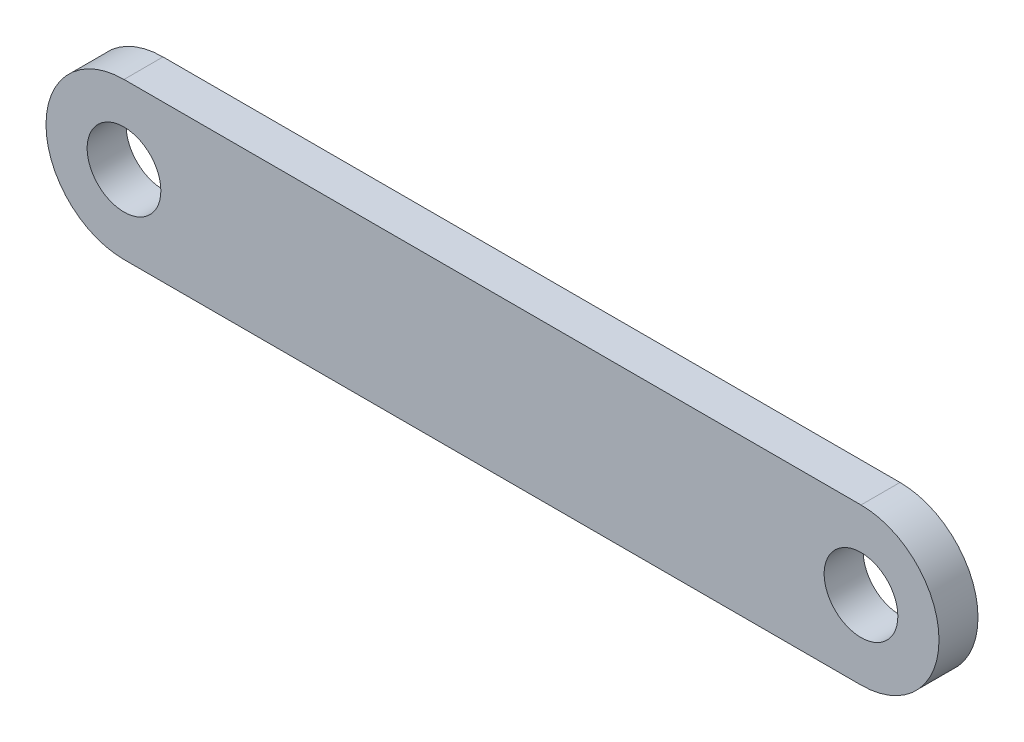
ISO-10303-21;
HEADER;
FILE_DESCRIPTION(('STEP AP214'),'2;1');
FILE_NAME('part.step','',(''),(''),'','','');
FILE_SCHEMA(('AUTOMOTIVE_DESIGN { 1 0 10303 214 1 1 1 1 }'));
ENDSEC;
DATA;
#1=APPLICATION_CONTEXT('core data for automotive mechanical design processes');
#2=APPLICATION_PROTOCOL_DEFINITION('international standard','automotive_design',2000,#1);
#3=PRODUCT_CONTEXT('',#1,'mechanical');
#4=PRODUCT('Part','Part','',(#3));
#5=PRODUCT_RELATED_PRODUCT_CATEGORY('part','',(#4));
#6=PRODUCT_DEFINITION_FORMATION('','',#4);
#7=PRODUCT_DEFINITION_CONTEXT('part definition',#1,'design');
#8=PRODUCT_DEFINITION('design','',#6,#7);
#9=PRODUCT_DEFINITION_SHAPE('','',#8);
#10=(LENGTH_UNIT() NAMED_UNIT(*) SI_UNIT(.MILLI.,.METRE.));
#11=(NAMED_UNIT(*) PLANE_ANGLE_UNIT() SI_UNIT($,.RADIAN.));
#12=(NAMED_UNIT(*) SI_UNIT($,.STERADIAN.) SOLID_ANGLE_UNIT());
#13=UNCERTAINTY_MEASURE_WITH_UNIT(LENGTH_MEASURE(1.E-05),#10,'distance_accuracy_value','');
#14=(GEOMETRIC_REPRESENTATION_CONTEXT(3) GLOBAL_UNCERTAINTY_ASSIGNED_CONTEXT((#13)) GLOBAL_UNIT_ASSIGNED_CONTEXT((#10,
#11,#12)) REPRESENTATION_CONTEXT('',''));
#15=CARTESIAN_POINT('',(0.,0.,0.));
#16=DIRECTION('',(0.,0.,1.));
#17=DIRECTION('',(1.,0.,0.));
#18=AXIS2_PLACEMENT_3D('',#15,#16,#17);
#19=CARTESIAN_POINT('',(60.,0.,-3.175));
#20=DIRECTION('',(0.,0.,1.));
#21=DIRECTION('',(1.,0.,0.));
#22=AXIS2_PLACEMENT_3D('',#19,#20,#21);
#23=CYLINDRICAL_SURFACE('',#22,6.35);
#24=CARTESIAN_POINT('',(60.,0.,0.));
#25=DIRECTION('',(0.,0.,1.));
#26=DIRECTION('',(1.,0.,0.));
#27=AXIS2_PLACEMENT_3D('',#24,#25,#26);
#28=CIRCLE('',#27,6.35);
#29=CARTESIAN_POINT('',(60.,-6.35,0.));
#30=VERTEX_POINT('',#29);
#31=CARTESIAN_POINT('',(60.,6.35,0.));
#32=VERTEX_POINT('',#31);
#33=EDGE_CURVE('E95',#30,#32,#28,.T.);
#34=ORIENTED_EDGE('',*,*,#33,.F.);
#35=DIRECTION('',(0.,0.,1.));
#36=VECTOR('',#35,1.);
#37=CARTESIAN_POINT('',(60.,-6.35,-3.175));
#38=LINE('',#37,#36);
#39=CARTESIAN_POINT('',(60.,-6.35,-3.175));
#40=VERTEX_POINT('',#39);
#41=EDGE_CURVE('E11',#40,#30,#38,.T.);
#42=ORIENTED_EDGE('',*,*,#41,.F.);
#43=CARTESIAN_POINT('',(60.,0.,-3.175));
#44=DIRECTION('',(0.,0.,1.));
#45=DIRECTION('',(1.,0.,0.));
#46=AXIS2_PLACEMENT_3D('',#43,#44,#45);
#47=CIRCLE('',#46,6.35);
#48=CARTESIAN_POINT('',(60.,6.35,-3.175));
#49=VERTEX_POINT('',#48);
#50=EDGE_CURVE('E88',#40,#49,#47,.T.);
#51=ORIENTED_EDGE('',*,*,#50,.T.);
#52=DIRECTION('',(0.,0.,1.));
#53=VECTOR('',#52,1.);
#54=CARTESIAN_POINT('',(60.,6.35,-3.175));
#55=LINE('',#54,#53);
#56=EDGE_CURVE('E33',#49,#32,#55,.T.);
#57=ORIENTED_EDGE('',*,*,#56,.T.);
#58=EDGE_LOOP('',(#34,#42,#51,#57));
#59=FACE_BOUND('',#58,.T.);
#60=ADVANCED_FACE('F30',(#59),#23,.T.);
#61=CARTESIAN_POINT('',(0.,-6.35,-3.175));
#62=DIRECTION('',(0.,-1.,0.));
#63=DIRECTION('',(0.,0.,-1.));
#64=AXIS2_PLACEMENT_3D('',#61,#62,#63);
#65=PLANE('',#64);
#66=DIRECTION('',(1.,0.,0.));
#67=VECTOR('',#66,1.);
#68=CARTESIAN_POINT('',(0.,-6.35,0.));
#69=LINE('',#68,#67);
#70=CARTESIAN_POINT('',(0.,-6.35,0.));
#71=VERTEX_POINT('',#70);
#72=EDGE_CURVE('E90',#71,#30,#69,.T.);
#73=ORIENTED_EDGE('',*,*,#72,.F.);
#74=DIRECTION('',(0.,0.,1.));
#75=VECTOR('',#74,1.);
#76=CARTESIAN_POINT('',(0.,-6.35,-3.175));
#77=LINE('',#76,#75);
#78=CARTESIAN_POINT('',(0.,-6.35,-3.175));
#79=VERTEX_POINT('',#78);
#80=EDGE_CURVE('E39',#79,#71,#77,.T.);
#81=ORIENTED_EDGE('',*,*,#80,.F.);
#82=DIRECTION('',(1.,0.,0.));
#83=VECTOR('',#82,1.);
#84=CARTESIAN_POINT('',(0.,-6.35,-3.175));
#85=LINE('',#84,#83);
#86=EDGE_CURVE('E85',#79,#40,#85,.T.);
#87=ORIENTED_EDGE('',*,*,#86,.T.);
#88=ORIENTED_EDGE('',*,*,#41,.T.);
#89=EDGE_LOOP('',(#73,#81,#87,#88));
#90=FACE_BOUND('',#89,.T.);
#91=ADVANCED_FACE('F106',(#90),#65,.T.);
#92=CARTESIAN_POINT('',(0.,0.,-3.175));
#93=DIRECTION('',(0.,0.,1.));
#94=DIRECTION('',(1.,0.,0.));
#95=AXIS2_PLACEMENT_3D('',#92,#93,#94);
#96=CYLINDRICAL_SURFACE('',#95,6.35);
#97=CARTESIAN_POINT('',(0.,0.,0.));
#98=DIRECTION('',(0.,0.,1.));
#99=DIRECTION('',(1.,0.,0.));
#100=AXIS2_PLACEMENT_3D('',#97,#98,#99);
#101=CIRCLE('',#100,6.35);
#102=CARTESIAN_POINT('',(0.,6.35,0.));
#103=VERTEX_POINT('',#102);
#104=EDGE_CURVE('E80',#103,#71,#101,.T.);
#105=ORIENTED_EDGE('',*,*,#104,.F.);
#106=DIRECTION('',(0.,0.,1.));
#107=VECTOR('',#106,1.);
#108=CARTESIAN_POINT('',(0.,6.35,-3.175));
#109=LINE('',#108,#107);
#110=CARTESIAN_POINT('',(0.,6.35,-3.175));
#111=VERTEX_POINT('',#110);
#112=EDGE_CURVE('E75',#111,#103,#109,.T.);
#113=ORIENTED_EDGE('',*,*,#112,.F.);
#114=CARTESIAN_POINT('',(0.,0.,-3.175));
#115=DIRECTION('',(0.,0.,1.));
#116=DIRECTION('',(1.,0.,0.));
#117=AXIS2_PLACEMENT_3D('',#114,#115,#116);
#118=CIRCLE('',#117,6.35);
#119=EDGE_CURVE('E78',#111,#79,#118,.T.);
#120=ORIENTED_EDGE('',*,*,#119,.T.);
#121=ORIENTED_EDGE('',*,*,#80,.T.);
#122=EDGE_LOOP('',(#105,#113,#120,#121));
#123=FACE_BOUND('',#122,.T.);
#124=ADVANCED_FACE('F77',(#123),#96,.T.);
#125=CARTESIAN_POINT('',(60.,6.35,-3.175));
#126=DIRECTION('',(0.,1.,0.));
#127=DIRECTION('',(-1.,0.,0.));
#128=AXIS2_PLACEMENT_3D('',#125,#126,#127);
#129=PLANE('',#128);
#130=DIRECTION('',(-1.,0.,0.));
#131=VECTOR('',#130,1.);
#132=CARTESIAN_POINT('',(60.,6.35,0.));
#133=LINE('',#132,#131);
#134=EDGE_CURVE('E98',#32,#103,#133,.T.);
#135=ORIENTED_EDGE('',*,*,#134,.F.);
#136=ORIENTED_EDGE('',*,*,#56,.F.);
#137=DIRECTION('',(-1.,0.,0.));
#138=VECTOR('',#137,1.);
#139=CARTESIAN_POINT('',(60.,6.35,-3.175));
#140=LINE('',#139,#138);
#141=EDGE_CURVE('E84',#49,#111,#140,.T.);
#142=ORIENTED_EDGE('',*,*,#141,.T.);
#143=ORIENTED_EDGE('',*,*,#112,.T.);
#144=EDGE_LOOP('',(#135,#136,#142,#143));
#145=FACE_BOUND('',#144,.T.);
#146=ADVANCED_FACE('F87',(#145),#129,.T.);
#147=CARTESIAN_POINT('',(60.,0.,-3.175));
#148=DIRECTION('',(0.,0.,1.));
#149=DIRECTION('',(1.,0.,0.));
#150=AXIS2_PLACEMENT_3D('',#147,#148,#149);
#151=PLANE('',#150);
#152=CARTESIAN_POINT('',(60.,0.,-3.175));
#153=DIRECTION('',(0.,0.,1.));
#154=DIRECTION('',(1.,0.,0.));
#155=AXIS2_PLACEMENT_3D('',#152,#153,#154);
#156=CIRCLE('',#155,3.00000000000001);
#157=CARTESIAN_POINT('',(63.,0.,-3.175));
#158=VERTEX_POINT('',#157);
#159=EDGE_CURVE('E139',#158,#158,#156,.T.);
#160=ORIENTED_EDGE('',*,*,#159,.T.);
#161=EDGE_LOOP('',(#160));
#162=FACE_BOUND('',#161,.T.);
#163=CARTESIAN_POINT('',(0.,0.,-3.175));
#164=DIRECTION('',(0.,0.,1.));
#165=DIRECTION('',(1.,0.,0.));
#166=AXIS2_PLACEMENT_3D('',#163,#164,#165);
#167=CIRCLE('',#166,3.);
#168=CARTESIAN_POINT('',(3.,0.,-3.175));
#169=VERTEX_POINT('',#168);
#170=EDGE_CURVE('E99',#169,#169,#167,.T.);
#171=ORIENTED_EDGE('',*,*,#170,.T.);
#172=EDGE_LOOP('',(#171));
#173=FACE_BOUND('',#172,.T.);
#174=ORIENTED_EDGE('',*,*,#50,.F.);
#175=ORIENTED_EDGE('',*,*,#86,.F.);
#176=ORIENTED_EDGE('',*,*,#119,.F.);
#177=ORIENTED_EDGE('',*,*,#141,.F.);
#178=EDGE_LOOP('',(#174,#175,#176,#177));
#179=FACE_BOUND('',#178,.T.);
#180=ADVANCED_FACE('F83',(#162,#173,#179),#151,.F.);
#181=CARTESIAN_POINT('',(60.,0.,0.));
#182=DIRECTION('',(0.,0.,1.));
#183=DIRECTION('',(1.,0.,0.));
#184=AXIS2_PLACEMENT_3D('',#181,#182,#183);
#185=PLANE('',#184);
#186=CARTESIAN_POINT('',(60.,0.,0.));
#187=DIRECTION('',(0.,0.,1.));
#188=DIRECTION('',(1.,0.,0.));
#189=AXIS2_PLACEMENT_3D('',#186,#187,#188);
#190=CIRCLE('',#189,3.00000000000001);
#191=CARTESIAN_POINT('',(63.,0.,0.));
#192=VERTEX_POINT('',#191);
#193=EDGE_CURVE('E142',#192,#192,#190,.T.);
#194=ORIENTED_EDGE('',*,*,#193,.F.);
#195=EDGE_LOOP('',(#194));
#196=FACE_BOUND('',#195,.T.);
#197=CARTESIAN_POINT('',(0.,0.,0.));
#198=DIRECTION('',(0.,0.,1.));
#199=DIRECTION('',(1.,0.,0.));
#200=AXIS2_PLACEMENT_3D('',#197,#198,#199);
#201=CIRCLE('',#200,3.);
#202=CARTESIAN_POINT('',(3.,0.,0.));
#203=VERTEX_POINT('',#202);
#204=EDGE_CURVE('E144',#203,#203,#201,.T.);
#205=ORIENTED_EDGE('',*,*,#204,.F.);
#206=EDGE_LOOP('',(#205));
#207=FACE_BOUND('',#206,.T.);
#208=ORIENTED_EDGE('',*,*,#33,.T.);
#209=ORIENTED_EDGE('',*,*,#134,.T.);
#210=ORIENTED_EDGE('',*,*,#104,.T.);
#211=ORIENTED_EDGE('',*,*,#72,.T.);
#212=EDGE_LOOP('',(#208,#209,#210,#211));
#213=FACE_BOUND('',#212,.T.);
#214=ADVANCED_FACE('F105',(#196,#207,#213),#185,.T.);
#215=CARTESIAN_POINT('',(0.,0.,-3.175));
#216=DIRECTION('',(0.,0.,1.));
#217=DIRECTION('',(1.,0.,0.));
#218=AXIS2_PLACEMENT_3D('',#215,#216,#217);
#219=CYLINDRICAL_SURFACE('',#218,3.);
#220=ORIENTED_EDGE('',*,*,#170,.F.);
#221=EDGE_LOOP('',(#220));
#222=FACE_BOUND('',#221,.T.);
#223=ORIENTED_EDGE('',*,*,#204,.T.);
#224=EDGE_LOOP('',(#223));
#225=FACE_BOUND('',#224,.T.);
#226=ADVANCED_FACE('F124',(#222,#225),#219,.F.);
#227=CARTESIAN_POINT('',(60.,0.,-3.175));
#228=DIRECTION('',(0.,0.,1.));
#229=DIRECTION('',(1.,0.,0.));
#230=AXIS2_PLACEMENT_3D('',#227,#228,#229);
#231=CYLINDRICAL_SURFACE('',#230,3.00000000000001);
#232=ORIENTED_EDGE('',*,*,#159,.F.);
#233=EDGE_LOOP('',(#232));
#234=FACE_BOUND('',#233,.T.);
#235=ORIENTED_EDGE('',*,*,#193,.T.);
#236=EDGE_LOOP('',(#235));
#237=FACE_BOUND('',#236,.T.);
#238=ADVANCED_FACE('F131',(#234,#237),#231,.F.);
#239=CLOSED_SHELL('',(#60,#91,#124,#146,#180,#214,#226,#238));
#240=MANIFOLD_SOLID_BREP('B2',#239);
#241=ADVANCED_BREP_SHAPE_REPRESENTATION('',(#18,#240),#14);
#242=SHAPE_DEFINITION_REPRESENTATION(#9,#241);
ENDSEC;
END-ISO-10303-21;
